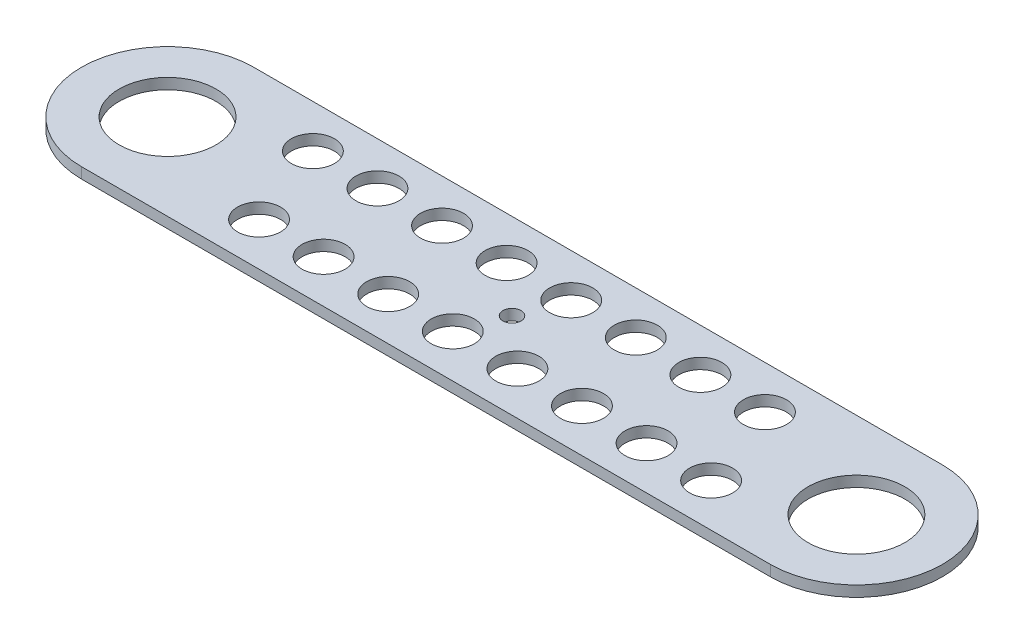
ISO-10303-21;
HEADER;
FILE_DESCRIPTION(('STEP AP214'),'2;1');
FILE_NAME('part.step','',(''),(''),'','','');
FILE_SCHEMA(('AUTOMOTIVE_DESIGN { 1 0 10303 214 1 1 1 1 }'));
ENDSEC;
DATA;
#1=APPLICATION_CONTEXT('core data for automotive mechanical design processes');
#2=APPLICATION_PROTOCOL_DEFINITION('international standard','automotive_design',2000,#1);
#3=PRODUCT_CONTEXT('',#1,'mechanical');
#4=PRODUCT('Part','Part','',(#3));
#5=PRODUCT_RELATED_PRODUCT_CATEGORY('part','',(#4));
#6=PRODUCT_DEFINITION_FORMATION('','',#4);
#7=PRODUCT_DEFINITION_CONTEXT('part definition',#1,'design');
#8=PRODUCT_DEFINITION('design','',#6,#7);
#9=PRODUCT_DEFINITION_SHAPE('','',#8);
#10=(LENGTH_UNIT() NAMED_UNIT(*) SI_UNIT(.MILLI.,.METRE.));
#11=(NAMED_UNIT(*) PLANE_ANGLE_UNIT() SI_UNIT($,.RADIAN.));
#12=(NAMED_UNIT(*) SI_UNIT($,.STERADIAN.) SOLID_ANGLE_UNIT());
#13=UNCERTAINTY_MEASURE_WITH_UNIT(LENGTH_MEASURE(1.E-05),#10,'distance_accuracy_value','');
#14=(GEOMETRIC_REPRESENTATION_CONTEXT(3) GLOBAL_UNCERTAINTY_ASSIGNED_CONTEXT((#13)) GLOBAL_UNIT_ASSIGNED_CONTEXT((#10,
#11,#12)) REPRESENTATION_CONTEXT('',''));
#15=CARTESIAN_POINT('',(0.,0.,0.));
#16=DIRECTION('',(0.,0.,1.));
#17=DIRECTION('',(1.,0.,0.));
#18=AXIS2_PLACEMENT_3D('',#15,#16,#17);
#19=CARTESIAN_POINT('',(0.,3.175,0.));
#20=DIRECTION('',(0.,1.,0.));
#21=DIRECTION('',(0.,0.,1.));
#22=AXIS2_PLACEMENT_3D('',#19,#20,#21);
#23=PLANE('',#22);
#24=CARTESIAN_POINT('',(125.4125,3.175,-12.7));
#25=DIRECTION('',(0.,1.,0.));
#26=DIRECTION('',(0.,0.,1.));
#27=AXIS2_PLACEMENT_3D('',#24,#25,#26);
#28=CIRCLE('',#27,6.35000000000002);
#29=CARTESIAN_POINT('',(125.4125,3.175,-6.35000000000001));
#30=VERTEX_POINT('',#29);
#31=EDGE_CURVE('E184',#30,#30,#28,.F.);
#32=ORIENTED_EDGE('',*,*,#31,.T.);
#33=EDGE_LOOP('',(#32));
#34=FACE_BOUND('',#33,.T.);
#35=CARTESIAN_POINT('',(144.4625,3.175,-12.7));
#36=DIRECTION('',(0.,1.,0.));
#37=DIRECTION('',(0.,0.,1.));
#38=AXIS2_PLACEMENT_3D('',#35,#36,#37);
#39=CIRCLE('',#38,6.35);
#40=CARTESIAN_POINT('',(144.4625,3.175,-6.35000000000004));
#41=VERTEX_POINT('',#40);
#42=EDGE_CURVE('E175',#41,#41,#39,.F.);
#43=ORIENTED_EDGE('',*,*,#42,.T.);
#44=EDGE_LOOP('',(#43));
#45=FACE_BOUND('',#44,.T.);
#46=CARTESIAN_POINT('',(163.5125,3.175,-12.7));
#47=DIRECTION('',(0.,1.,0.));
#48=DIRECTION('',(0.,0.,1.));
#49=AXIS2_PLACEMENT_3D('',#46,#47,#48);
#50=CIRCLE('',#49,6.35);
#51=CARTESIAN_POINT('',(163.5125,3.175,-6.35000000000004));
#52=VERTEX_POINT('',#51);
#53=EDGE_CURVE('E198',#52,#52,#50,.F.);
#54=ORIENTED_EDGE('',*,*,#53,.T.);
#55=EDGE_LOOP('',(#54));
#56=FACE_BOUND('',#55,.T.);
#57=CARTESIAN_POINT('',(39.6875,3.175,12.7));
#58=DIRECTION('',(0.,1.,0.));
#59=DIRECTION('',(0.,0.,1.));
#60=AXIS2_PLACEMENT_3D('',#57,#58,#59);
#61=CIRCLE('',#60,6.35);
#62=CARTESIAN_POINT('',(39.6875,3.175,19.05));
#63=VERTEX_POINT('',#62);
#64=EDGE_CURVE('E189',#63,#63,#61,.F.);
#65=ORIENTED_EDGE('',*,*,#64,.T.);
#66=EDGE_LOOP('',(#65));
#67=FACE_BOUND('',#66,.T.);
#68=CARTESIAN_POINT('',(106.3625,3.175,-12.7));
#69=DIRECTION('',(0.,1.,0.));
#70=DIRECTION('',(0.,0.,1.));
#71=AXIS2_PLACEMENT_3D('',#68,#69,#70);
#72=CIRCLE('',#71,6.35);
#73=CARTESIAN_POINT('',(106.3625,3.175,-6.35000000000004));
#74=VERTEX_POINT('',#73);
#75=EDGE_CURVE('E145',#74,#74,#72,.F.);
#76=ORIENTED_EDGE('',*,*,#75,.T.);
#77=EDGE_LOOP('',(#76));
#78=FACE_BOUND('',#77,.T.);
#79=CARTESIAN_POINT('',(87.3125,3.175,-12.7));
#80=DIRECTION('',(0.,1.,0.));
#81=DIRECTION('',(0.,0.,1.));
#82=AXIS2_PLACEMENT_3D('',#79,#80,#81);
#83=CIRCLE('',#82,6.35);
#84=CARTESIAN_POINT('',(87.3125,3.175,-6.35000000000004));
#85=VERTEX_POINT('',#84);
#86=EDGE_CURVE('E152',#85,#85,#83,.F.);
#87=ORIENTED_EDGE('',*,*,#86,.T.);
#88=EDGE_LOOP('',(#87));
#89=FACE_BOUND('',#88,.T.);
#90=CARTESIAN_POINT('',(68.2625,3.175,-12.7));
#91=DIRECTION('',(0.,1.,0.));
#92=DIRECTION('',(0.,0.,1.));
#93=AXIS2_PLACEMENT_3D('',#90,#91,#92);
#94=CIRCLE('',#93,6.35);
#95=CARTESIAN_POINT('',(68.2625,3.175,-6.35000000000004));
#96=VERTEX_POINT('',#95);
#97=EDGE_CURVE('E160',#96,#96,#94,.F.);
#98=ORIENTED_EDGE('',*,*,#97,.T.);
#99=EDGE_LOOP('',(#98));
#100=FACE_BOUND('',#99,.T.);
#101=CARTESIAN_POINT('',(49.2125,3.175,-12.7));
#102=DIRECTION('',(0.,1.,0.));
#103=DIRECTION('',(0.,0.,1.));
#104=AXIS2_PLACEMENT_3D('',#101,#102,#103);
#105=CIRCLE('',#104,6.35);
#106=CARTESIAN_POINT('',(49.2125,3.175,-6.35000000000004));
#107=VERTEX_POINT('',#106);
#108=EDGE_CURVE('E168',#107,#107,#105,.F.);
#109=ORIENTED_EDGE('',*,*,#108,.T.);
#110=EDGE_LOOP('',(#109));
#111=FACE_BOUND('',#110,.T.);
#112=CARTESIAN_POINT('',(58.7375,3.175,12.7));
#113=DIRECTION('',(0.,1.,0.));
#114=DIRECTION('',(0.,0.,1.));
#115=AXIS2_PLACEMENT_3D('',#112,#113,#114);
#116=CIRCLE('',#115,6.35000000000001);
#117=CARTESIAN_POINT('',(58.7375,3.175,19.05));
#118=VERTEX_POINT('',#117);
#119=EDGE_CURVE('E247',#118,#118,#116,.F.);
#120=ORIENTED_EDGE('',*,*,#119,.T.);
#121=EDGE_LOOP('',(#120));
#122=FACE_BOUND('',#121,.T.);
#123=CARTESIAN_POINT('',(77.7875,3.175,12.7));
#124=DIRECTION('',(0.,1.,0.));
#125=DIRECTION('',(0.,0.,1.));
#126=AXIS2_PLACEMENT_3D('',#123,#124,#125);
#127=CIRCLE('',#126,6.35000000000001);
#128=CARTESIAN_POINT('',(77.7875,3.175,19.05));
#129=VERTEX_POINT('',#128);
#130=EDGE_CURVE('E241',#129,#129,#127,.F.);
#131=ORIENTED_EDGE('',*,*,#130,.T.);
#132=EDGE_LOOP('',(#131));
#133=FACE_BOUND('',#132,.T.);
#134=CARTESIAN_POINT('',(96.8375,3.175,12.7));
#135=DIRECTION('',(0.,1.,0.));
#136=DIRECTION('',(0.,0.,1.));
#137=AXIS2_PLACEMENT_3D('',#134,#135,#136);
#138=CIRCLE('',#137,6.35);
#139=CARTESIAN_POINT('',(96.8375,3.175,19.05));
#140=VERTEX_POINT('',#139);
#141=EDGE_CURVE('E235',#140,#140,#138,.F.);
#142=ORIENTED_EDGE('',*,*,#141,.T.);
#143=EDGE_LOOP('',(#142));
#144=FACE_BOUND('',#143,.T.);
#145=CARTESIAN_POINT('',(115.8875,3.175,12.7));
#146=DIRECTION('',(0.,1.,0.));
#147=DIRECTION('',(0.,0.,1.));
#148=AXIS2_PLACEMENT_3D('',#145,#146,#147);
#149=CIRCLE('',#148,6.35000000000001);
#150=CARTESIAN_POINT('',(115.8875,3.175,19.05));
#151=VERTEX_POINT('',#150);
#152=EDGE_CURVE('E229',#151,#151,#149,.F.);
#153=ORIENTED_EDGE('',*,*,#152,.T.);
#154=EDGE_LOOP('',(#153));
#155=FACE_BOUND('',#154,.T.);
#156=CARTESIAN_POINT('',(134.9375,3.175,12.7));
#157=DIRECTION('',(0.,1.,0.));
#158=DIRECTION('',(0.,0.,1.));
#159=AXIS2_PLACEMENT_3D('',#156,#157,#158);
#160=CIRCLE('',#159,6.35);
#161=CARTESIAN_POINT('',(134.9375,3.175,19.05));
#162=VERTEX_POINT('',#161);
#163=EDGE_CURVE('E221',#162,#162,#160,.F.);
#164=ORIENTED_EDGE('',*,*,#163,.T.);
#165=EDGE_LOOP('',(#164));
#166=FACE_BOUND('',#165,.T.);
#167=CARTESIAN_POINT('',(153.9875,3.175,12.7));
#168=DIRECTION('',(0.,1.,0.));
#169=DIRECTION('',(0.,0.,1.));
#170=AXIS2_PLACEMENT_3D('',#167,#168,#169);
#171=CIRCLE('',#170,6.35);
#172=CARTESIAN_POINT('',(153.9875,3.175,19.05));
#173=VERTEX_POINT('',#172);
#174=EDGE_CURVE('E213',#173,#173,#171,.F.);
#175=ORIENTED_EDGE('',*,*,#174,.T.);
#176=EDGE_LOOP('',(#175));
#177=FACE_BOUND('',#176,.T.);
#178=CARTESIAN_POINT('',(173.0375,3.175,12.7));
#179=DIRECTION('',(0.,1.,0.));
#180=DIRECTION('',(0.,0.,1.));
#181=AXIS2_PLACEMENT_3D('',#178,#179,#180);
#182=CIRCLE('',#181,6.35);
#183=CARTESIAN_POINT('',(173.0375,3.175,19.05));
#184=VERTEX_POINT('',#183);
#185=EDGE_CURVE('E205',#184,#184,#182,.F.);
#186=ORIENTED_EDGE('',*,*,#185,.T.);
#187=EDGE_LOOP('',(#186));
#188=FACE_BOUND('',#187,.T.);
#189=CARTESIAN_POINT('',(30.1625,3.175,-12.7));
#190=DIRECTION('',(0.,1.,0.));
#191=DIRECTION('',(0.,0.,1.));
#192=AXIS2_PLACEMENT_3D('',#189,#190,#191);
#193=CIRCLE('',#192,6.35);
#194=CARTESIAN_POINT('',(30.1625,3.175,-6.35000000000004));
#195=VERTEX_POINT('',#194);
#196=EDGE_CURVE('E139',#195,#195,#193,.F.);
#197=ORIENTED_EDGE('',*,*,#196,.T.);
#198=EDGE_LOOP('',(#197));
#199=FACE_BOUND('',#198,.T.);
#200=CARTESIAN_POINT('',(101.6,3.175,0.));
#201=DIRECTION('',(0.,1.,0.));
#202=DIRECTION('',(0.,0.,1.));
#203=AXIS2_PLACEMENT_3D('',#200,#201,#202);
#204=CIRCLE('',#203,2.667);
#205=CARTESIAN_POINT('',(101.6,3.175,2.667));
#206=VERTEX_POINT('',#205);
#207=EDGE_CURVE('E135',#206,#206,#204,.T.);
#208=ORIENTED_EDGE('',*,*,#207,.F.);
#209=EDGE_LOOP('',(#208));
#210=FACE_BOUND('',#209,.T.);
#211=CARTESIAN_POINT('',(0.,3.175,0.));
#212=DIRECTION('',(0.,1.,0.));
#213=DIRECTION('',(0.,0.,1.));
#214=AXIS2_PLACEMENT_3D('',#211,#212,#213);
#215=CIRCLE('',#214,14.2875);
#216=CARTESIAN_POINT('',(0.,3.175,14.2875));
#217=VERTEX_POINT('',#216);
#218=EDGE_CURVE('E107',#217,#217,#215,.T.);
#219=ORIENTED_EDGE('',*,*,#218,.F.);
#220=EDGE_LOOP('',(#219));
#221=FACE_BOUND('',#220,.T.);
#222=CARTESIAN_POINT('',(0.,3.175,0.));
#223=DIRECTION('',(0.,1.,0.));
#224=DIRECTION('',(0.,0.,1.));
#225=AXIS2_PLACEMENT_3D('',#222,#223,#224);
#226=CIRCLE('',#225,25.4);
#227=CARTESIAN_POINT('',(0.,3.175,-25.4));
#228=VERTEX_POINT('',#227);
#229=CARTESIAN_POINT('',(0.,3.175,25.4));
#230=VERTEX_POINT('',#229);
#231=EDGE_CURVE('E90',#228,#230,#226,.T.);
#232=ORIENTED_EDGE('',*,*,#231,.T.);
#233=DIRECTION('',(1.,0.,0.));
#234=VECTOR('',#233,1.);
#235=CARTESIAN_POINT('',(0.,3.175,25.4));
#236=LINE('',#235,#234);
#237=CARTESIAN_POINT('',(203.2,3.175,25.4));
#238=VERTEX_POINT('',#237);
#239=EDGE_CURVE('E85',#230,#238,#236,.T.);
#240=ORIENTED_EDGE('',*,*,#239,.T.);
#241=CARTESIAN_POINT('',(203.2,3.175,0.));
#242=DIRECTION('',(0.,1.,0.));
#243=DIRECTION('',(0.,0.,1.));
#244=AXIS2_PLACEMENT_3D('',#241,#242,#243);
#245=CIRCLE('',#244,25.4);
#246=CARTESIAN_POINT('',(203.2,3.175,-25.4));
#247=VERTEX_POINT('',#246);
#248=EDGE_CURVE('E88',#238,#247,#245,.T.);
#249=ORIENTED_EDGE('',*,*,#248,.T.);
#250=DIRECTION('',(-1.,0.,0.));
#251=VECTOR('',#250,1.);
#252=CARTESIAN_POINT('',(0.,3.175,-25.4));
#253=LINE('',#252,#251);
#254=EDGE_CURVE('E55',#247,#228,#253,.T.);
#255=ORIENTED_EDGE('',*,*,#254,.T.);
#256=EDGE_LOOP('',(#232,#240,#249,#255));
#257=FACE_BOUND('',#256,.T.);
#258=CARTESIAN_POINT('',(203.2,3.175,0.));
#259=DIRECTION('',(0.,1.,0.));
#260=DIRECTION('',(0.,0.,1.));
#261=AXIS2_PLACEMENT_3D('',#258,#259,#260);
#262=CIRCLE('',#261,14.2875);
#263=CARTESIAN_POINT('',(203.2,3.175,14.2875));
#264=VERTEX_POINT('',#263);
#265=EDGE_CURVE('E124',#264,#264,#262,.T.);
#266=ORIENTED_EDGE('',*,*,#265,.F.);
#267=EDGE_LOOP('',(#266));
#268=FACE_BOUND('',#267,.T.);
#269=ADVANCED_FACE('F38',(#34,#45,#56,#67,#78,#89,#100,#111,#122,#133,#144,#155,#166,#177,#188,
#199,#210,#221,#257,#268),#23,.T.);
#270=CARTESIAN_POINT('',(0.,0.,0.));
#271=DIRECTION('',(0.,1.,0.));
#272=DIRECTION('',(0.,0.,1.));
#273=AXIS2_PLACEMENT_3D('',#270,#271,#272);
#274=PLANE('',#273);
#275=CARTESIAN_POINT('',(125.4125,0.,-12.7));
#276=DIRECTION('',(0.,-1.,0.));
#277=DIRECTION('',(0.,0.,-1.));
#278=AXIS2_PLACEMENT_3D('',#275,#276,#277);
#279=CIRCLE('',#278,6.35000000000002);
#280=CARTESIAN_POINT('',(125.4125,0.,-19.0500000000001));
#281=VERTEX_POINT('',#280);
#282=EDGE_CURVE('E149',#281,#281,#279,.T.);
#283=ORIENTED_EDGE('',*,*,#282,.F.);
#284=EDGE_LOOP('',(#283));
#285=FACE_BOUND('',#284,.T.);
#286=CARTESIAN_POINT('',(144.4625,0.,-12.7));
#287=DIRECTION('',(0.,-1.,0.));
#288=DIRECTION('',(0.,0.,-1.));
#289=AXIS2_PLACEMENT_3D('',#286,#287,#288);
#290=CIRCLE('',#289,6.35);
#291=CARTESIAN_POINT('',(144.4625,0.,-19.05));
#292=VERTEX_POINT('',#291);
#293=EDGE_CURVE('E179',#292,#292,#290,.T.);
#294=ORIENTED_EDGE('',*,*,#293,.F.);
#295=EDGE_LOOP('',(#294));
#296=FACE_BOUND('',#295,.T.);
#297=CARTESIAN_POINT('',(163.5125,0.,-12.7));
#298=DIRECTION('',(0.,-1.,0.));
#299=DIRECTION('',(0.,0.,-1.));
#300=AXIS2_PLACEMENT_3D('',#297,#298,#299);
#301=CIRCLE('',#300,6.35);
#302=CARTESIAN_POINT('',(163.5125,0.,-19.05));
#303=VERTEX_POINT('',#302);
#304=EDGE_CURVE('E180',#303,#303,#301,.T.);
#305=ORIENTED_EDGE('',*,*,#304,.F.);
#306=EDGE_LOOP('',(#305));
#307=FACE_BOUND('',#306,.T.);
#308=CARTESIAN_POINT('',(39.6875,0.,12.7));
#309=DIRECTION('',(0.,-1.,0.));
#310=DIRECTION('',(0.,0.,-1.));
#311=AXIS2_PLACEMENT_3D('',#308,#309,#310);
#312=CIRCLE('',#311,6.35);
#313=CARTESIAN_POINT('',(39.6875,0.,6.35));
#314=VERTEX_POINT('',#313);
#315=EDGE_CURVE('E193',#314,#314,#312,.T.);
#316=ORIENTED_EDGE('',*,*,#315,.F.);
#317=EDGE_LOOP('',(#316));
#318=FACE_BOUND('',#317,.T.);
#319=CARTESIAN_POINT('',(106.3625,0.,-12.7));
#320=DIRECTION('',(0.,-1.,0.));
#321=DIRECTION('',(0.,0.,-1.));
#322=AXIS2_PLACEMENT_3D('',#319,#320,#321);
#323=CIRCLE('',#322,6.35);
#324=CARTESIAN_POINT('',(106.3625,0.,-19.05));
#325=VERTEX_POINT('',#324);
#326=EDGE_CURVE('E148',#325,#325,#323,.T.);
#327=ORIENTED_EDGE('',*,*,#326,.F.);
#328=EDGE_LOOP('',(#327));
#329=FACE_BOUND('',#328,.T.);
#330=CARTESIAN_POINT('',(87.3125,0.,-12.7));
#331=DIRECTION('',(0.,-1.,0.));
#332=DIRECTION('',(0.,0.,-1.));
#333=AXIS2_PLACEMENT_3D('',#330,#331,#332);
#334=CIRCLE('',#333,6.35);
#335=CARTESIAN_POINT('',(87.3125,0.,-19.05));
#336=VERTEX_POINT('',#335);
#337=EDGE_CURVE('E156',#336,#336,#334,.T.);
#338=ORIENTED_EDGE('',*,*,#337,.F.);
#339=EDGE_LOOP('',(#338));
#340=FACE_BOUND('',#339,.T.);
#341=CARTESIAN_POINT('',(68.2625,0.,-12.7));
#342=DIRECTION('',(0.,-1.,0.));
#343=DIRECTION('',(0.,0.,-1.));
#344=AXIS2_PLACEMENT_3D('',#341,#342,#343);
#345=CIRCLE('',#344,6.35);
#346=CARTESIAN_POINT('',(68.2625,0.,-19.05));
#347=VERTEX_POINT('',#346);
#348=EDGE_CURVE('E164',#347,#347,#345,.T.);
#349=ORIENTED_EDGE('',*,*,#348,.F.);
#350=EDGE_LOOP('',(#349));
#351=FACE_BOUND('',#350,.T.);
#352=CARTESIAN_POINT('',(49.2125,0.,-12.7));
#353=DIRECTION('',(0.,-1.,0.));
#354=DIRECTION('',(0.,0.,-1.));
#355=AXIS2_PLACEMENT_3D('',#352,#353,#354);
#356=CIRCLE('',#355,6.35);
#357=CARTESIAN_POINT('',(49.2125,0.,-19.05));
#358=VERTEX_POINT('',#357);
#359=EDGE_CURVE('E142',#358,#358,#356,.T.);
#360=ORIENTED_EDGE('',*,*,#359,.F.);
#361=EDGE_LOOP('',(#360));
#362=FACE_BOUND('',#361,.T.);
#363=CARTESIAN_POINT('',(58.7375,0.,12.7));
#364=DIRECTION('',(0.,-1.,0.));
#365=DIRECTION('',(0.,0.,-1.));
#366=AXIS2_PLACEMENT_3D('',#363,#364,#365);
#367=CIRCLE('',#366,6.35000000000001);
#368=CARTESIAN_POINT('',(58.7375,0.,6.34999999999999));
#369=VERTEX_POINT('',#368);
#370=EDGE_CURVE('E194',#369,#369,#367,.T.);
#371=ORIENTED_EDGE('',*,*,#370,.F.);
#372=EDGE_LOOP('',(#371));
#373=FACE_BOUND('',#372,.T.);
#374=CARTESIAN_POINT('',(77.7875,0.,12.7));
#375=DIRECTION('',(0.,-1.,0.));
#376=DIRECTION('',(0.,0.,-1.));
#377=AXIS2_PLACEMENT_3D('',#374,#375,#376);
#378=CIRCLE('',#377,6.35000000000001);
#379=CARTESIAN_POINT('',(77.7875,0.,6.34999999999999));
#380=VERTEX_POINT('',#379);
#381=EDGE_CURVE('E244',#380,#380,#378,.T.);
#382=ORIENTED_EDGE('',*,*,#381,.F.);
#383=EDGE_LOOP('',(#382));
#384=FACE_BOUND('',#383,.T.);
#385=CARTESIAN_POINT('',(96.8375,0.,12.7));
#386=DIRECTION('',(0.,-1.,0.));
#387=DIRECTION('',(0.,0.,-1.));
#388=AXIS2_PLACEMENT_3D('',#385,#386,#387);
#389=CIRCLE('',#388,6.35);
#390=CARTESIAN_POINT('',(96.8375,0.,6.35));
#391=VERTEX_POINT('',#390);
#392=EDGE_CURVE('E238',#391,#391,#389,.T.);
#393=ORIENTED_EDGE('',*,*,#392,.F.);
#394=EDGE_LOOP('',(#393));
#395=FACE_BOUND('',#394,.T.);
#396=CARTESIAN_POINT('',(115.8875,0.,12.7));
#397=DIRECTION('',(0.,-1.,0.));
#398=DIRECTION('',(0.,0.,-1.));
#399=AXIS2_PLACEMENT_3D('',#396,#397,#398);
#400=CIRCLE('',#399,6.35000000000001);
#401=CARTESIAN_POINT('',(115.8875,0.,6.34999999999999));
#402=VERTEX_POINT('',#401);
#403=EDGE_CURVE('E232',#402,#402,#400,.T.);
#404=ORIENTED_EDGE('',*,*,#403,.F.);
#405=EDGE_LOOP('',(#404));
#406=FACE_BOUND('',#405,.T.);
#407=CARTESIAN_POINT('',(134.9375,0.,12.7));
#408=DIRECTION('',(0.,-1.,0.));
#409=DIRECTION('',(0.,0.,-1.));
#410=AXIS2_PLACEMENT_3D('',#407,#408,#409);
#411=CIRCLE('',#410,6.35);
#412=CARTESIAN_POINT('',(134.9375,0.,6.35));
#413=VERTEX_POINT('',#412);
#414=EDGE_CURVE('E225',#413,#413,#411,.T.);
#415=ORIENTED_EDGE('',*,*,#414,.F.);
#416=EDGE_LOOP('',(#415));
#417=FACE_BOUND('',#416,.T.);
#418=CARTESIAN_POINT('',(153.9875,0.,12.7));
#419=DIRECTION('',(0.,-1.,0.));
#420=DIRECTION('',(0.,0.,-1.));
#421=AXIS2_PLACEMENT_3D('',#418,#419,#420);
#422=CIRCLE('',#421,6.35);
#423=CARTESIAN_POINT('',(153.9875,0.,6.35));
#424=VERTEX_POINT('',#423);
#425=EDGE_CURVE('E217',#424,#424,#422,.T.);
#426=ORIENTED_EDGE('',*,*,#425,.F.);
#427=EDGE_LOOP('',(#426));
#428=FACE_BOUND('',#427,.T.);
#429=CARTESIAN_POINT('',(173.0375,0.,12.7));
#430=DIRECTION('',(0.,-1.,0.));
#431=DIRECTION('',(0.,0.,-1.));
#432=AXIS2_PLACEMENT_3D('',#429,#430,#431);
#433=CIRCLE('',#432,6.35);
#434=CARTESIAN_POINT('',(173.0375,0.,6.35));
#435=VERTEX_POINT('',#434);
#436=EDGE_CURVE('E209',#435,#435,#433,.T.);
#437=ORIENTED_EDGE('',*,*,#436,.F.);
#438=EDGE_LOOP('',(#437));
#439=FACE_BOUND('',#438,.T.);
#440=CARTESIAN_POINT('',(30.1625,0.,-12.7));
#441=DIRECTION('',(0.,-1.,0.));
#442=DIRECTION('',(0.,0.,-1.));
#443=AXIS2_PLACEMENT_3D('',#440,#441,#442);
#444=CIRCLE('',#443,6.35);
#445=CARTESIAN_POINT('',(30.1625,0.,-19.05));
#446=VERTEX_POINT('',#445);
#447=EDGE_CURVE('E138',#446,#446,#444,.T.);
#448=ORIENTED_EDGE('',*,*,#447,.F.);
#449=EDGE_LOOP('',(#448));
#450=FACE_BOUND('',#449,.T.);
#451=CARTESIAN_POINT('',(101.6,0.,0.));
#452=DIRECTION('',(0.,1.,0.));
#453=DIRECTION('',(0.,0.,1.));
#454=AXIS2_PLACEMENT_3D('',#451,#452,#453);
#455=CIRCLE('',#454,2.667);
#456=CARTESIAN_POINT('',(101.6,0.,2.667));
#457=VERTEX_POINT('',#456);
#458=EDGE_CURVE('E130',#457,#457,#455,.F.);
#459=ORIENTED_EDGE('',*,*,#458,.F.);
#460=EDGE_LOOP('',(#459));
#461=FACE_BOUND('',#460,.T.);
#462=CARTESIAN_POINT('',(0.,0.,0.));
#463=DIRECTION('',(0.,1.,0.));
#464=DIRECTION('',(0.,0.,1.));
#465=AXIS2_PLACEMENT_3D('',#462,#463,#464);
#466=CIRCLE('',#465,25.4);
#467=CARTESIAN_POINT('',(0.,0.,-25.4));
#468=VERTEX_POINT('',#467);
#469=CARTESIAN_POINT('',(0.,0.,25.4));
#470=VERTEX_POINT('',#469);
#471=EDGE_CURVE('E104',#468,#470,#466,.T.);
#472=ORIENTED_EDGE('',*,*,#471,.F.);
#473=DIRECTION('',(-1.,0.,0.));
#474=VECTOR('',#473,1.);
#475=CARTESIAN_POINT('',(0.,0.,-25.4));
#476=LINE('',#475,#474);
#477=CARTESIAN_POINT('',(203.2,0.,-25.4));
#478=VERTEX_POINT('',#477);
#479=EDGE_CURVE('E78',#478,#468,#476,.T.);
#480=ORIENTED_EDGE('',*,*,#479,.F.);
#481=CARTESIAN_POINT('',(203.2,0.,0.));
#482=DIRECTION('',(0.,1.,0.));
#483=DIRECTION('',(0.,0.,1.));
#484=AXIS2_PLACEMENT_3D('',#481,#482,#483);
#485=CIRCLE('',#484,25.4);
#486=CARTESIAN_POINT('',(203.2,0.,25.4));
#487=VERTEX_POINT('',#486);
#488=EDGE_CURVE('E72',#487,#478,#485,.T.);
#489=ORIENTED_EDGE('',*,*,#488,.F.);
#490=DIRECTION('',(1.,0.,0.));
#491=VECTOR('',#490,1.);
#492=CARTESIAN_POINT('',(0.,0.,25.4));
#493=LINE('',#492,#491);
#494=EDGE_CURVE('E95',#470,#487,#493,.T.);
#495=ORIENTED_EDGE('',*,*,#494,.F.);
#496=EDGE_LOOP('',(#472,#480,#489,#495));
#497=FACE_BOUND('',#496,.T.);
#498=CARTESIAN_POINT('',(0.,0.,0.));
#499=DIRECTION('',(0.,1.,0.));
#500=DIRECTION('',(0.,0.,1.));
#501=AXIS2_PLACEMENT_3D('',#498,#499,#500);
#502=CIRCLE('',#501,14.2875);
#503=CARTESIAN_POINT('',(0.,0.,14.2875));
#504=VERTEX_POINT('',#503);
#505=EDGE_CURVE('E121',#504,#504,#502,.T.);
#506=ORIENTED_EDGE('',*,*,#505,.T.);
#507=EDGE_LOOP('',(#506));
#508=FACE_BOUND('',#507,.T.);
#509=CARTESIAN_POINT('',(203.2,0.,0.));
#510=DIRECTION('',(0.,1.,0.));
#511=DIRECTION('',(0.,0.,1.));
#512=AXIS2_PLACEMENT_3D('',#509,#510,#511);
#513=CIRCLE('',#512,14.2875);
#514=CARTESIAN_POINT('',(203.2,0.,14.2875));
#515=VERTEX_POINT('',#514);
#516=EDGE_CURVE('E127',#515,#515,#513,.T.);
#517=ORIENTED_EDGE('',*,*,#516,.T.);
#518=EDGE_LOOP('',(#517));
#519=FACE_BOUND('',#518,.T.);
#520=ADVANCED_FACE('F117',(#285,#296,#307,#318,#329,#340,#351,#362,#373,#384,#395,#406,#417,
#428,#439,#450,#461,#497,#508,#519),#274,.F.);
#521=CARTESIAN_POINT('',(0.,3.175,0.));
#522=DIRECTION('',(0.,-1.,0.));
#523=DIRECTION('',(0.,0.,-1.));
#524=AXIS2_PLACEMENT_3D('',#521,#522,#523);
#525=CYLINDRICAL_SURFACE('',#524,25.4);
#526=ORIENTED_EDGE('',*,*,#471,.T.);
#527=DIRECTION('',(0.,-1.,0.));
#528=VECTOR('',#527,1.);
#529=CARTESIAN_POINT('',(0.,3.175,25.4));
#530=LINE('',#529,#528);
#531=EDGE_CURVE('E11',#230,#470,#530,.T.);
#532=ORIENTED_EDGE('',*,*,#531,.F.);
#533=ORIENTED_EDGE('',*,*,#231,.F.);
#534=DIRECTION('',(0.,-1.,0.));
#535=VECTOR('',#534,1.);
#536=CARTESIAN_POINT('',(0.,3.175,-25.4));
#537=LINE('',#536,#535);
#538=EDGE_CURVE('E100',#228,#468,#537,.T.);
#539=ORIENTED_EDGE('',*,*,#538,.T.);
#540=EDGE_LOOP('',(#526,#532,#533,#539));
#541=FACE_BOUND('',#540,.T.);
#542=ADVANCED_FACE('F40',(#541),#525,.T.);
#543=CARTESIAN_POINT('',(0.,3.175,25.4));
#544=DIRECTION('',(0.,0.,-1.));
#545=DIRECTION('',(-1.,0.,0.));
#546=AXIS2_PLACEMENT_3D('',#543,#544,#545);
#547=PLANE('',#546);
#548=ORIENTED_EDGE('',*,*,#494,.T.);
#549=DIRECTION('',(0.,-1.,0.));
#550=VECTOR('',#549,1.);
#551=CARTESIAN_POINT('',(203.2,3.175,25.4));
#552=LINE('',#551,#550);
#553=EDGE_CURVE('E47',#238,#487,#552,.T.);
#554=ORIENTED_EDGE('',*,*,#553,.F.);
#555=ORIENTED_EDGE('',*,*,#239,.F.);
#556=ORIENTED_EDGE('',*,*,#531,.T.);
#557=EDGE_LOOP('',(#548,#554,#555,#556));
#558=FACE_BOUND('',#557,.T.);
#559=ADVANCED_FACE('F94',(#558),#547,.F.);
#560=CARTESIAN_POINT('',(203.2,3.175,0.));
#561=DIRECTION('',(0.,-1.,0.));
#562=DIRECTION('',(0.,0.,-1.));
#563=AXIS2_PLACEMENT_3D('',#560,#561,#562);
#564=CYLINDRICAL_SURFACE('',#563,25.4);
#565=ORIENTED_EDGE('',*,*,#488,.T.);
#566=DIRECTION('',(0.,-1.,0.));
#567=VECTOR('',#566,1.);
#568=CARTESIAN_POINT('',(203.2,3.175,-25.4));
#569=LINE('',#568,#567);
#570=EDGE_CURVE('E96',#247,#478,#569,.T.);
#571=ORIENTED_EDGE('',*,*,#570,.F.);
#572=ORIENTED_EDGE('',*,*,#248,.F.);
#573=ORIENTED_EDGE('',*,*,#553,.T.);
#574=EDGE_LOOP('',(#565,#571,#572,#573));
#575=FACE_BOUND('',#574,.T.);
#576=ADVANCED_FACE('F97',(#575),#564,.T.);
#577=CARTESIAN_POINT('',(0.,3.175,-25.4));
#578=DIRECTION('',(0.,0.,1.));
#579=DIRECTION('',(1.,0.,0.));
#580=AXIS2_PLACEMENT_3D('',#577,#578,#579);
#581=PLANE('',#580);
#582=ORIENTED_EDGE('',*,*,#479,.T.);
#583=ORIENTED_EDGE('',*,*,#538,.F.);
#584=ORIENTED_EDGE('',*,*,#254,.F.);
#585=ORIENTED_EDGE('',*,*,#570,.T.);
#586=EDGE_LOOP('',(#582,#583,#584,#585));
#587=FACE_BOUND('',#586,.T.);
#588=ADVANCED_FACE('F114',(#587),#581,.F.);
#589=CARTESIAN_POINT('',(0.,3.175,0.));
#590=DIRECTION('',(0.,-1.,0.));
#591=DIRECTION('',(0.,0.,-1.));
#592=AXIS2_PLACEMENT_3D('',#589,#590,#591);
#593=CYLINDRICAL_SURFACE('',#592,14.2875);
#594=ORIENTED_EDGE('',*,*,#218,.T.);
#595=EDGE_LOOP('',(#594));
#596=FACE_BOUND('',#595,.T.);
#597=ORIENTED_EDGE('',*,*,#505,.F.);
#598=EDGE_LOOP('',(#597));
#599=FACE_BOUND('',#598,.T.);
#600=ADVANCED_FACE('F290',(#596,#599),#593,.F.);
#601=CARTESIAN_POINT('',(203.2,3.175,0.));
#602=DIRECTION('',(0.,-1.,0.));
#603=DIRECTION('',(0.,0.,-1.));
#604=AXIS2_PLACEMENT_3D('',#601,#602,#603);
#605=CYLINDRICAL_SURFACE('',#604,14.2875);
#606=ORIENTED_EDGE('',*,*,#265,.T.);
#607=EDGE_LOOP('',(#606));
#608=FACE_BOUND('',#607,.T.);
#609=ORIENTED_EDGE('',*,*,#516,.F.);
#610=EDGE_LOOP('',(#609));
#611=FACE_BOUND('',#610,.T.);
#612=ADVANCED_FACE('F280',(#608,#611),#605,.F.);
#613=CARTESIAN_POINT('',(101.6,-0.00100000000000013,0.));
#614=DIRECTION('',(0.,1.,0.));
#615=DIRECTION('',(0.,0.,1.));
#616=AXIS2_PLACEMENT_3D('',#613,#614,#615);
#617=CYLINDRICAL_SURFACE('',#616,2.667);
#618=ORIENTED_EDGE('',*,*,#207,.T.);
#619=EDGE_LOOP('',(#618));
#620=FACE_BOUND('',#619,.T.);
#621=ORIENTED_EDGE('',*,*,#458,.T.);
#622=EDGE_LOOP('',(#621));
#623=FACE_BOUND('',#622,.T.);
#624=ADVANCED_FACE('F277',(#620,#623),#617,.F.);
#625=CARTESIAN_POINT('',(30.1625,3.176,-12.7));
#626=DIRECTION('',(0.,-1.,0.));
#627=DIRECTION('',(0.,0.,-1.));
#628=AXIS2_PLACEMENT_3D('',#625,#626,#627);
#629=CYLINDRICAL_SURFACE('',#628,6.35);
#630=ORIENTED_EDGE('',*,*,#196,.F.);
#631=EDGE_LOOP('',(#630));
#632=FACE_BOUND('',#631,.T.);
#633=ORIENTED_EDGE('',*,*,#447,.T.);
#634=EDGE_LOOP('',(#633));
#635=FACE_BOUND('',#634,.T.);
#636=ADVANCED_FACE('F279',(#632,#635),#629,.F.);
#637=CARTESIAN_POINT('',(173.0375,3.176,12.7));
#638=DIRECTION('',(0.,-1.,0.));
#639=DIRECTION('',(0.,0.,-1.));
#640=AXIS2_PLACEMENT_3D('',#637,#638,#639);
#641=CYLINDRICAL_SURFACE('',#640,6.35);
#642=ORIENTED_EDGE('',*,*,#185,.F.);
#643=EDGE_LOOP('',(#642));
#644=FACE_BOUND('',#643,.T.);
#645=ORIENTED_EDGE('',*,*,#436,.T.);
#646=EDGE_LOOP('',(#645));
#647=FACE_BOUND('',#646,.T.);
#648=ADVANCED_FACE('F287',(#644,#647),#641,.F.);
#649=CARTESIAN_POINT('',(153.9875,3.176,12.7));
#650=DIRECTION('',(0.,-1.,0.));
#651=DIRECTION('',(0.,0.,-1.));
#652=AXIS2_PLACEMENT_3D('',#649,#650,#651);
#653=CYLINDRICAL_SURFACE('',#652,6.35);
#654=ORIENTED_EDGE('',*,*,#174,.F.);
#655=EDGE_LOOP('',(#654));
#656=FACE_BOUND('',#655,.T.);
#657=ORIENTED_EDGE('',*,*,#425,.T.);
#658=EDGE_LOOP('',(#657));
#659=FACE_BOUND('',#658,.T.);
#660=ADVANCED_FACE('F378',(#656,#659),#653,.F.);
#661=CARTESIAN_POINT('',(134.9375,3.176,12.7));
#662=DIRECTION('',(0.,-1.,0.));
#663=DIRECTION('',(0.,0.,-1.));
#664=AXIS2_PLACEMENT_3D('',#661,#662,#663);
#665=CYLINDRICAL_SURFACE('',#664,6.35);
#666=ORIENTED_EDGE('',*,*,#163,.F.);
#667=EDGE_LOOP('',(#666));
#668=FACE_BOUND('',#667,.T.);
#669=ORIENTED_EDGE('',*,*,#414,.T.);
#670=EDGE_LOOP('',(#669));
#671=FACE_BOUND('',#670,.T.);
#672=ADVANCED_FACE('F387',(#668,#671),#665,.F.);
#673=CARTESIAN_POINT('',(115.8875,3.176,12.7));
#674=DIRECTION('',(0.,-1.,0.));
#675=DIRECTION('',(0.,0.,-1.));
#676=AXIS2_PLACEMENT_3D('',#673,#674,#675);
#677=CYLINDRICAL_SURFACE('',#676,6.35000000000001);
#678=ORIENTED_EDGE('',*,*,#152,.F.);
#679=EDGE_LOOP('',(#678));
#680=FACE_BOUND('',#679,.T.);
#681=ORIENTED_EDGE('',*,*,#403,.T.);
#682=EDGE_LOOP('',(#681));
#683=FACE_BOUND('',#682,.T.);
#684=ADVANCED_FACE('F396',(#680,#683),#677,.F.);
#685=CARTESIAN_POINT('',(96.8375,3.176,12.7));
#686=DIRECTION('',(0.,-1.,0.));
#687=DIRECTION('',(0.,0.,-1.));
#688=AXIS2_PLACEMENT_3D('',#685,#686,#687);
#689=CYLINDRICAL_SURFACE('',#688,6.35);
#690=ORIENTED_EDGE('',*,*,#141,.F.);
#691=EDGE_LOOP('',(#690));
#692=FACE_BOUND('',#691,.T.);
#693=ORIENTED_EDGE('',*,*,#392,.T.);
#694=EDGE_LOOP('',(#693));
#695=FACE_BOUND('',#694,.T.);
#696=ADVANCED_FACE('F405',(#692,#695),#689,.F.);
#697=CARTESIAN_POINT('',(77.7875,3.176,12.7));
#698=DIRECTION('',(0.,-1.,0.));
#699=DIRECTION('',(0.,0.,-1.));
#700=AXIS2_PLACEMENT_3D('',#697,#698,#699);
#701=CYLINDRICAL_SURFACE('',#700,6.35000000000001);
#702=ORIENTED_EDGE('',*,*,#130,.F.);
#703=EDGE_LOOP('',(#702));
#704=FACE_BOUND('',#703,.T.);
#705=ORIENTED_EDGE('',*,*,#381,.T.);
#706=EDGE_LOOP('',(#705));
#707=FACE_BOUND('',#706,.T.);
#708=ADVANCED_FACE('F414',(#704,#707),#701,.F.);
#709=CARTESIAN_POINT('',(58.7375,3.176,12.7));
#710=DIRECTION('',(0.,-1.,0.));
#711=DIRECTION('',(0.,0.,-1.));
#712=AXIS2_PLACEMENT_3D('',#709,#710,#711);
#713=CYLINDRICAL_SURFACE('',#712,6.35000000000001);
#714=ORIENTED_EDGE('',*,*,#119,.F.);
#715=EDGE_LOOP('',(#714));
#716=FACE_BOUND('',#715,.T.);
#717=ORIENTED_EDGE('',*,*,#370,.T.);
#718=EDGE_LOOP('',(#717));
#719=FACE_BOUND('',#718,.T.);
#720=ADVANCED_FACE('F255',(#716,#719),#713,.F.);
#721=CARTESIAN_POINT('',(49.2125,3.176,-12.7));
#722=DIRECTION('',(0.,-1.,0.));
#723=DIRECTION('',(0.,0.,-1.));
#724=AXIS2_PLACEMENT_3D('',#721,#722,#723);
#725=CYLINDRICAL_SURFACE('',#724,6.35);
#726=ORIENTED_EDGE('',*,*,#108,.F.);
#727=EDGE_LOOP('',(#726));
#728=FACE_BOUND('',#727,.T.);
#729=ORIENTED_EDGE('',*,*,#359,.T.);
#730=EDGE_LOOP('',(#729));
#731=FACE_BOUND('',#730,.T.);
#732=ADVANCED_FACE('F431',(#728,#731),#725,.F.);
#733=CARTESIAN_POINT('',(68.2625,3.176,-12.7));
#734=DIRECTION('',(0.,-1.,0.));
#735=DIRECTION('',(0.,0.,-1.));
#736=AXIS2_PLACEMENT_3D('',#733,#734,#735);
#737=CYLINDRICAL_SURFACE('',#736,6.35);
#738=ORIENTED_EDGE('',*,*,#97,.F.);
#739=EDGE_LOOP('',(#738));
#740=FACE_BOUND('',#739,.T.);
#741=ORIENTED_EDGE('',*,*,#348,.T.);
#742=EDGE_LOOP('',(#741));
#743=FACE_BOUND('',#742,.T.);
#744=ADVANCED_FACE('F440',(#740,#743),#737,.F.);
#745=CARTESIAN_POINT('',(87.3125,3.176,-12.7));
#746=DIRECTION('',(0.,-1.,0.));
#747=DIRECTION('',(0.,0.,-1.));
#748=AXIS2_PLACEMENT_3D('',#745,#746,#747);
#749=CYLINDRICAL_SURFACE('',#748,6.35);
#750=ORIENTED_EDGE('',*,*,#86,.F.);
#751=EDGE_LOOP('',(#750));
#752=FACE_BOUND('',#751,.T.);
#753=ORIENTED_EDGE('',*,*,#337,.T.);
#754=EDGE_LOOP('',(#753));
#755=FACE_BOUND('',#754,.T.);
#756=ADVANCED_FACE('F449',(#752,#755),#749,.F.);
#757=CARTESIAN_POINT('',(106.3625,3.176,-12.7));
#758=DIRECTION('',(0.,-1.,0.));
#759=DIRECTION('',(0.,0.,-1.));
#760=AXIS2_PLACEMENT_3D('',#757,#758,#759);
#761=CYLINDRICAL_SURFACE('',#760,6.35);
#762=ORIENTED_EDGE('',*,*,#75,.F.);
#763=EDGE_LOOP('',(#762));
#764=FACE_BOUND('',#763,.T.);
#765=ORIENTED_EDGE('',*,*,#326,.T.);
#766=EDGE_LOOP('',(#765));
#767=FACE_BOUND('',#766,.T.);
#768=ADVANCED_FACE('F458',(#764,#767),#761,.F.);
#769=CARTESIAN_POINT('',(39.6875,3.176,12.7));
#770=DIRECTION('',(0.,-1.,0.));
#771=DIRECTION('',(0.,0.,-1.));
#772=AXIS2_PLACEMENT_3D('',#769,#770,#771);
#773=CYLINDRICAL_SURFACE('',#772,6.35);
#774=ORIENTED_EDGE('',*,*,#64,.F.);
#775=EDGE_LOOP('',(#774));
#776=FACE_BOUND('',#775,.T.);
#777=ORIENTED_EDGE('',*,*,#315,.T.);
#778=EDGE_LOOP('',(#777));
#779=FACE_BOUND('',#778,.T.);
#780=ADVANCED_FACE('F467',(#776,#779),#773,.F.);
#781=CARTESIAN_POINT('',(163.5125,3.176,-12.7));
#782=DIRECTION('',(0.,-1.,0.));
#783=DIRECTION('',(0.,0.,-1.));
#784=AXIS2_PLACEMENT_3D('',#781,#782,#783);
#785=CYLINDRICAL_SURFACE('',#784,6.35);
#786=ORIENTED_EDGE('',*,*,#53,.F.);
#787=EDGE_LOOP('',(#786));
#788=FACE_BOUND('',#787,.T.);
#789=ORIENTED_EDGE('',*,*,#304,.T.);
#790=EDGE_LOOP('',(#789));
#791=FACE_BOUND('',#790,.T.);
#792=ADVANCED_FACE('F476',(#788,#791),#785,.F.);
#793=CARTESIAN_POINT('',(144.4625,3.176,-12.7));
#794=DIRECTION('',(0.,-1.,0.));
#795=DIRECTION('',(0.,0.,-1.));
#796=AXIS2_PLACEMENT_3D('',#793,#794,#795);
#797=CYLINDRICAL_SURFACE('',#796,6.35);
#798=ORIENTED_EDGE('',*,*,#42,.F.);
#799=EDGE_LOOP('',(#798));
#800=FACE_BOUND('',#799,.T.);
#801=ORIENTED_EDGE('',*,*,#293,.T.);
#802=EDGE_LOOP('',(#801));
#803=FACE_BOUND('',#802,.T.);
#804=ADVANCED_FACE('F485',(#800,#803),#797,.F.);
#805=CARTESIAN_POINT('',(125.4125,3.176,-12.7));
#806=DIRECTION('',(0.,-1.,0.));
#807=DIRECTION('',(0.,0.,-1.));
#808=AXIS2_PLACEMENT_3D('',#805,#806,#807);
#809=CYLINDRICAL_SURFACE('',#808,6.35000000000002);
#810=ORIENTED_EDGE('',*,*,#31,.F.);
#811=EDGE_LOOP('',(#810));
#812=FACE_BOUND('',#811,.T.);
#813=ORIENTED_EDGE('',*,*,#282,.T.);
#814=EDGE_LOOP('',(#813));
#815=FACE_BOUND('',#814,.T.);
#816=ADVANCED_FACE('F494',(#812,#815),#809,.F.);
#817=CLOSED_SHELL('',(#269,#520,#542,#559,#576,#588,#600,#612,#624,#636,#648,#660,#672,#684,
#696,#708,#720,#732,#744,#756,#768,#780,#792,#804,#816));
#818=MANIFOLD_SOLID_BREP('B2',#817);
#819=ADVANCED_BREP_SHAPE_REPRESENTATION('',(#18,#818),#14);
#820=SHAPE_DEFINITION_REPRESENTATION(#9,#819);
ENDSEC;
END-ISO-10303-21;
